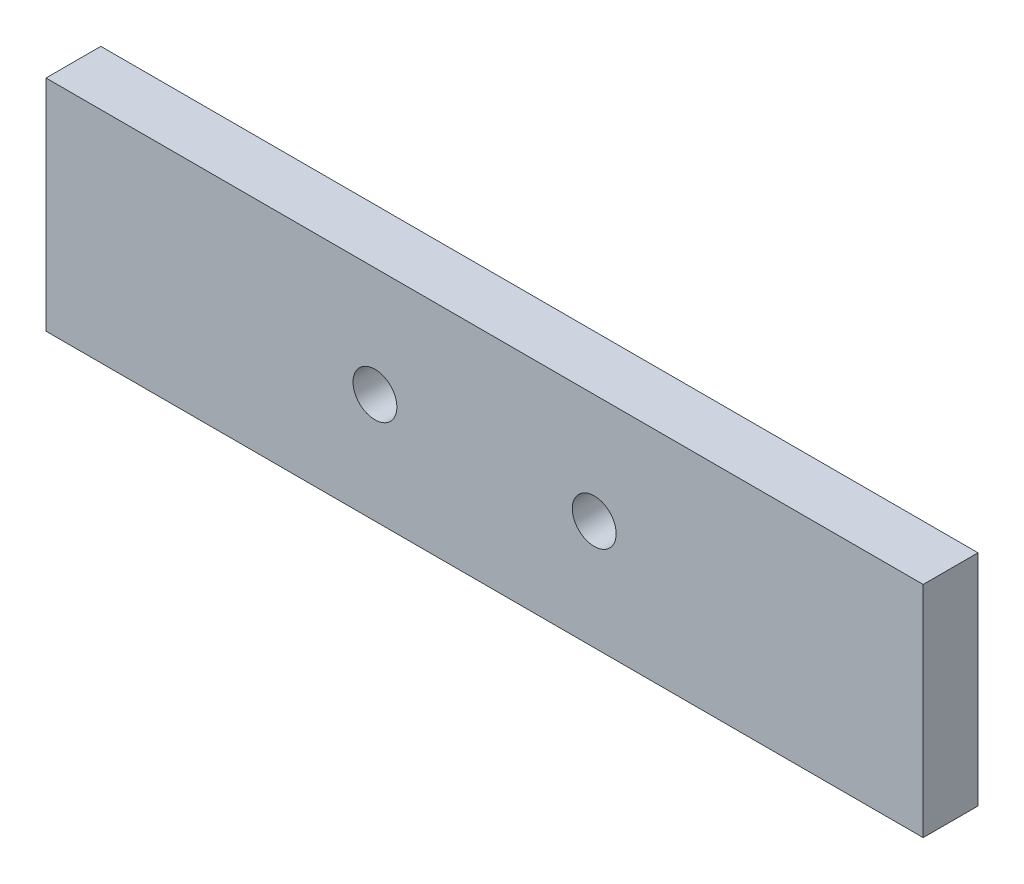
ISO-10303-21;
HEADER;
FILE_DESCRIPTION(('STEP AP214'),'2;1');
FILE_NAME('part.step','',(''),(''),'','','');
FILE_SCHEMA(('AUTOMOTIVE_DESIGN { 1 0 10303 214 1 1 1 1 }'));
ENDSEC;
DATA;
#1=APPLICATION_CONTEXT('core data for automotive mechanical design processes');
#2=APPLICATION_PROTOCOL_DEFINITION('international standard','automotive_design',2000,#1);
#3=PRODUCT_CONTEXT('',#1,'mechanical');
#4=PRODUCT('Part','Part','',(#3));
#5=PRODUCT_RELATED_PRODUCT_CATEGORY('part','',(#4));
#6=PRODUCT_DEFINITION_FORMATION('','',#4);
#7=PRODUCT_DEFINITION_CONTEXT('part definition',#1,'design');
#8=PRODUCT_DEFINITION('design','',#6,#7);
#9=PRODUCT_DEFINITION_SHAPE('','',#8);
#10=(LENGTH_UNIT() NAMED_UNIT(*) SI_UNIT(.MILLI.,.METRE.));
#11=(NAMED_UNIT(*) PLANE_ANGLE_UNIT() SI_UNIT($,.RADIAN.));
#12=(NAMED_UNIT(*) SI_UNIT($,.STERADIAN.) SOLID_ANGLE_UNIT());
#13=UNCERTAINTY_MEASURE_WITH_UNIT(LENGTH_MEASURE(1.E-05),#10,'distance_accuracy_value','');
#14=(GEOMETRIC_REPRESENTATION_CONTEXT(3) GLOBAL_UNCERTAINTY_ASSIGNED_CONTEXT((#13)) GLOBAL_UNIT_ASSIGNED_CONTEXT((#10,
#11,#12)) REPRESENTATION_CONTEXT('',''));
#15=CARTESIAN_POINT('',(0.,0.,0.));
#16=DIRECTION('',(0.,0.,1.));
#17=DIRECTION('',(1.,0.,0.));
#18=AXIS2_PLACEMENT_3D('',#15,#16,#17);
#19=CARTESIAN_POINT('',(8.,10.,5.));
#20=DIRECTION('',(0.,0.,-1.));
#21=DIRECTION('',(-1.,0.,0.));
#22=AXIS2_PLACEMENT_3D('',#19,#20,#21);
#23=CYLINDRICAL_SURFACE('',#22,4.05);
#24=CARTESIAN_POINT('',(8.,10.,0.));
#25=DIRECTION('',(0.,0.,1.));
#26=DIRECTION('',(1.,0.,0.));
#27=AXIS2_PLACEMENT_3D('',#24,#25,#26);
#28=CIRCLE('',#27,4.05);
#29=CARTESIAN_POINT('',(12.05,10.,0.));
#30=VERTEX_POINT('',#29);
#31=EDGE_CURVE('E141',#30,#30,#28,.T.);
#32=ORIENTED_EDGE('',*,*,#31,.F.);
#33=EDGE_LOOP('',(#32));
#34=FACE_BOUND('',#33,.T.);
#35=CARTESIAN_POINT('',(8.,10.,2.9));
#36=DIRECTION('',(0.,0.,1.));
#37=DIRECTION('',(1.,0.,0.));
#38=AXIS2_PLACEMENT_3D('',#35,#36,#37);
#39=CIRCLE('',#38,4.05);
#40=CARTESIAN_POINT('',(12.05,10.,2.9));
#41=VERTEX_POINT('',#40);
#42=EDGE_CURVE('E49',#41,#41,#39,.T.);
#43=ORIENTED_EDGE('',*,*,#42,.T.);
#44=EDGE_LOOP('',(#43));
#45=FACE_BOUND('',#44,.T.);
#46=ADVANCED_FACE('F45',(#34,#45),#23,.F.);
#47=CARTESIAN_POINT('',(72.,10.,5.));
#48=DIRECTION('',(0.,0.,-1.));
#49=DIRECTION('',(-1.,0.,0.));
#50=AXIS2_PLACEMENT_3D('',#47,#48,#49);
#51=CYLINDRICAL_SURFACE('',#50,4.05);
#52=CARTESIAN_POINT('',(72.,10.,0.));
#53=DIRECTION('',(0.,0.,1.));
#54=DIRECTION('',(1.,0.,0.));
#55=AXIS2_PLACEMENT_3D('',#52,#53,#54);
#56=CIRCLE('',#55,4.05);
#57=CARTESIAN_POINT('',(76.05,10.,0.));
#58=VERTEX_POINT('',#57);
#59=EDGE_CURVE('E135',#58,#58,#56,.T.);
#60=ORIENTED_EDGE('',*,*,#59,.F.);
#61=EDGE_LOOP('',(#60));
#62=FACE_BOUND('',#61,.T.);
#63=CARTESIAN_POINT('',(72.,10.,2.9));
#64=DIRECTION('',(0.,0.,1.));
#65=DIRECTION('',(1.,0.,0.));
#66=AXIS2_PLACEMENT_3D('',#63,#64,#65);
#67=CIRCLE('',#66,4.05);
#68=CARTESIAN_POINT('',(76.05,10.,2.9));
#69=VERTEX_POINT('',#68);
#70=EDGE_CURVE('E132',#69,#69,#67,.T.);
#71=ORIENTED_EDGE('',*,*,#70,.T.);
#72=EDGE_LOOP('',(#71));
#73=FACE_BOUND('',#72,.T.);
#74=ADVANCED_FACE('F158',(#62,#73),#51,.F.);
#75=CARTESIAN_POINT('',(0.,0.,5.));
#76=DIRECTION('',(0.,0.,-1.));
#77=DIRECTION('',(-1.,0.,0.));
#78=AXIS2_PLACEMENT_3D('',#75,#76,#77);
#79=PLANE('',#78);
#80=DIRECTION('',(0.,-1.,0.));
#81=VECTOR('',#80,1.);
#82=CARTESIAN_POINT('',(0.,0.,5.));
#83=LINE('',#82,#81);
#84=CARTESIAN_POINT('',(0.,20.,5.));
#85=VERTEX_POINT('',#84);
#86=CARTESIAN_POINT('',(0.,0.,5.));
#87=VERTEX_POINT('',#86);
#88=EDGE_CURVE('E101',#85,#87,#83,.T.);
#89=ORIENTED_EDGE('',*,*,#88,.T.);
#90=DIRECTION('',(1.,0.,0.));
#91=VECTOR('',#90,1.);
#92=CARTESIAN_POINT('',(0.,0.,5.));
#93=LINE('',#92,#91);
#94=CARTESIAN_POINT('',(80.,0.,5.));
#95=VERTEX_POINT('',#94);
#96=EDGE_CURVE('E95',#87,#95,#93,.T.);
#97=ORIENTED_EDGE('',*,*,#96,.T.);
#98=DIRECTION('',(0.,1.,0.));
#99=VECTOR('',#98,1.);
#100=CARTESIAN_POINT('',(80.,0.,5.));
#101=LINE('',#100,#99);
#102=CARTESIAN_POINT('',(80.,20.,5.));
#103=VERTEX_POINT('',#102);
#104=EDGE_CURVE('E99',#95,#103,#101,.T.);
#105=ORIENTED_EDGE('',*,*,#104,.T.);
#106=DIRECTION('',(-1.,0.,0.));
#107=VECTOR('',#106,1.);
#108=CARTESIAN_POINT('',(0.,20.,5.));
#109=LINE('',#108,#107);
#110=EDGE_CURVE('E65',#103,#85,#109,.T.);
#111=ORIENTED_EDGE('',*,*,#110,.T.);
#112=EDGE_LOOP('',(#89,#97,#105,#111));
#113=FACE_BOUND('',#112,.T.);
#114=CARTESIAN_POINT('',(30.,10.,5.));
#115=DIRECTION('',(0.,0.,1.));
#116=DIRECTION('',(1.,0.,0.));
#117=AXIS2_PLACEMENT_3D('',#114,#115,#116);
#118=CIRCLE('',#117,2.);
#119=CARTESIAN_POINT('',(32.,10.,5.));
#120=VERTEX_POINT('',#119);
#121=EDGE_CURVE('E122',#120,#120,#118,.T.);
#122=ORIENTED_EDGE('',*,*,#121,.F.);
#123=EDGE_LOOP('',(#122));
#124=FACE_BOUND('',#123,.T.);
#125=CARTESIAN_POINT('',(50.,10.,5.));
#126=DIRECTION('',(0.,0.,1.));
#127=DIRECTION('',(1.,0.,0.));
#128=AXIS2_PLACEMENT_3D('',#125,#126,#127);
#129=CIRCLE('',#128,2.);
#130=CARTESIAN_POINT('',(52.,10.,5.));
#131=VERTEX_POINT('',#130);
#132=EDGE_CURVE('E202',#131,#131,#129,.T.);
#133=ORIENTED_EDGE('',*,*,#132,.F.);
#134=EDGE_LOOP('',(#133));
#135=FACE_BOUND('',#134,.T.);
#136=ADVANCED_FACE('F96',(#113,#124,#135),#79,.F.);
#137=CARTESIAN_POINT('',(0.,0.,0.));
#138=DIRECTION('',(0.,0.,-1.));
#139=DIRECTION('',(-1.,0.,0.));
#140=AXIS2_PLACEMENT_3D('',#137,#138,#139);
#141=PLANE('',#140);
#142=ORIENTED_EDGE('',*,*,#31,.T.);
#143=EDGE_LOOP('',(#142));
#144=FACE_BOUND('',#143,.T.);
#145=CARTESIAN_POINT('',(30.,10.,0.));
#146=DIRECTION('',(0.,0.,1.));
#147=DIRECTION('',(1.,0.,0.));
#148=AXIS2_PLACEMENT_3D('',#145,#146,#147);
#149=CIRCLE('',#148,2.);
#150=CARTESIAN_POINT('',(32.,10.,0.));
#151=VERTEX_POINT('',#150);
#152=EDGE_CURVE('E207',#151,#151,#149,.T.);
#153=ORIENTED_EDGE('',*,*,#152,.T.);
#154=EDGE_LOOP('',(#153));
#155=FACE_BOUND('',#154,.T.);
#156=DIRECTION('',(0.,-1.,0.));
#157=VECTOR('',#156,1.);
#158=CARTESIAN_POINT('',(0.,0.,0.));
#159=LINE('',#158,#157);
#160=CARTESIAN_POINT('',(0.,20.,0.));
#161=VERTEX_POINT('',#160);
#162=CARTESIAN_POINT('',(0.,0.,0.));
#163=VERTEX_POINT('',#162);
#164=EDGE_CURVE('E118',#161,#163,#159,.T.);
#165=ORIENTED_EDGE('',*,*,#164,.F.);
#166=DIRECTION('',(-1.,0.,0.));
#167=VECTOR('',#166,1.);
#168=CARTESIAN_POINT('',(0.,20.,0.));
#169=LINE('',#168,#167);
#170=CARTESIAN_POINT('',(80.,20.,0.));
#171=VERTEX_POINT('',#170);
#172=EDGE_CURVE('E88',#171,#161,#169,.T.);
#173=ORIENTED_EDGE('',*,*,#172,.F.);
#174=DIRECTION('',(0.,1.,0.));
#175=VECTOR('',#174,1.);
#176=CARTESIAN_POINT('',(80.,0.,0.));
#177=LINE('',#176,#175);
#178=CARTESIAN_POINT('',(80.,0.,0.));
#179=VERTEX_POINT('',#178);
#180=EDGE_CURVE('E82',#179,#171,#177,.T.);
#181=ORIENTED_EDGE('',*,*,#180,.F.);
#182=DIRECTION('',(1.,0.,0.));
#183=VECTOR('',#182,1.);
#184=CARTESIAN_POINT('',(0.,0.,0.));
#185=LINE('',#184,#183);
#186=EDGE_CURVE('E106',#163,#179,#185,.T.);
#187=ORIENTED_EDGE('',*,*,#186,.F.);
#188=EDGE_LOOP('',(#165,#173,#181,#187));
#189=FACE_BOUND('',#188,.T.);
#190=CARTESIAN_POINT('',(50.,10.,0.));
#191=DIRECTION('',(0.,0.,1.));
#192=DIRECTION('',(1.,0.,0.));
#193=AXIS2_PLACEMENT_3D('',#190,#191,#192);
#194=CIRCLE('',#193,2.);
#195=CARTESIAN_POINT('',(52.,10.,0.));
#196=VERTEX_POINT('',#195);
#197=EDGE_CURVE('E198',#196,#196,#194,.T.);
#198=ORIENTED_EDGE('',*,*,#197,.T.);
#199=EDGE_LOOP('',(#198));
#200=FACE_BOUND('',#199,.T.);
#201=ORIENTED_EDGE('',*,*,#59,.T.);
#202=EDGE_LOOP('',(#201));
#203=FACE_BOUND('',#202,.T.);
#204=ADVANCED_FACE('F178',(#144,#155,#189,#200,#203),#141,.T.);
#205=CARTESIAN_POINT('',(0.,0.,5.));
#206=DIRECTION('',(1.,0.,0.));
#207=DIRECTION('',(0.,0.,-1.));
#208=AXIS2_PLACEMENT_3D('',#205,#206,#207);
#209=PLANE('',#208);
#210=ORIENTED_EDGE('',*,*,#164,.T.);
#211=DIRECTION('',(0.,0.,-1.));
#212=VECTOR('',#211,1.);
#213=CARTESIAN_POINT('',(0.,0.,5.));
#214=LINE('',#213,#212);
#215=EDGE_CURVE('E11',#87,#163,#214,.T.);
#216=ORIENTED_EDGE('',*,*,#215,.F.);
#217=ORIENTED_EDGE('',*,*,#88,.F.);
#218=DIRECTION('',(0.,0.,-1.));
#219=VECTOR('',#218,1.);
#220=CARTESIAN_POINT('',(0.,20.,5.));
#221=LINE('',#220,#219);
#222=EDGE_CURVE('E114',#85,#161,#221,.T.);
#223=ORIENTED_EDGE('',*,*,#222,.T.);
#224=EDGE_LOOP('',(#210,#216,#217,#223));
#225=FACE_BOUND('',#224,.T.);
#226=ADVANCED_FACE('F47',(#225),#209,.F.);
#227=CARTESIAN_POINT('',(0.,0.,5.));
#228=DIRECTION('',(0.,1.,0.));
#229=DIRECTION('',(0.,0.,1.));
#230=AXIS2_PLACEMENT_3D('',#227,#228,#229);
#231=PLANE('',#230);
#232=ORIENTED_EDGE('',*,*,#186,.T.);
#233=DIRECTION('',(0.,0.,-1.));
#234=VECTOR('',#233,1.);
#235=CARTESIAN_POINT('',(80.,0.,5.));
#236=LINE('',#235,#234);
#237=EDGE_CURVE('E56',#95,#179,#236,.T.);
#238=ORIENTED_EDGE('',*,*,#237,.F.);
#239=ORIENTED_EDGE('',*,*,#96,.F.);
#240=ORIENTED_EDGE('',*,*,#215,.T.);
#241=EDGE_LOOP('',(#232,#238,#239,#240));
#242=FACE_BOUND('',#241,.T.);
#243=ADVANCED_FACE('F105',(#242),#231,.F.);
#244=CARTESIAN_POINT('',(80.,0.,5.));
#245=DIRECTION('',(-1.,0.,0.));
#246=DIRECTION('',(0.,0.,1.));
#247=AXIS2_PLACEMENT_3D('',#244,#245,#246);
#248=PLANE('',#247);
#249=ORIENTED_EDGE('',*,*,#180,.T.);
#250=DIRECTION('',(0.,0.,-1.));
#251=VECTOR('',#250,1.);
#252=CARTESIAN_POINT('',(80.,20.,5.));
#253=LINE('',#252,#251);
#254=EDGE_CURVE('E108',#103,#171,#253,.T.);
#255=ORIENTED_EDGE('',*,*,#254,.F.);
#256=ORIENTED_EDGE('',*,*,#104,.F.);
#257=ORIENTED_EDGE('',*,*,#237,.T.);
#258=EDGE_LOOP('',(#249,#255,#256,#257));
#259=FACE_BOUND('',#258,.T.);
#260=ADVANCED_FACE('F110',(#259),#248,.F.);
#261=CARTESIAN_POINT('',(0.,20.,5.));
#262=DIRECTION('',(0.,-1.,0.));
#263=DIRECTION('',(0.,0.,-1.));
#264=AXIS2_PLACEMENT_3D('',#261,#262,#263);
#265=PLANE('',#264);
#266=ORIENTED_EDGE('',*,*,#172,.T.);
#267=ORIENTED_EDGE('',*,*,#222,.F.);
#268=ORIENTED_EDGE('',*,*,#110,.F.);
#269=ORIENTED_EDGE('',*,*,#254,.T.);
#270=EDGE_LOOP('',(#266,#267,#268,#269));
#271=FACE_BOUND('',#270,.T.);
#272=ADVANCED_FACE('F174',(#271),#265,.F.);
#273=CARTESIAN_POINT('',(30.,10.,5.));
#274=DIRECTION('',(0.,0.,-1.));
#275=DIRECTION('',(-1.,0.,0.));
#276=AXIS2_PLACEMENT_3D('',#273,#274,#275);
#277=CYLINDRICAL_SURFACE('',#276,2.);
#278=ORIENTED_EDGE('',*,*,#121,.T.);
#279=EDGE_LOOP('',(#278));
#280=FACE_BOUND('',#279,.T.);
#281=ORIENTED_EDGE('',*,*,#152,.F.);
#282=EDGE_LOOP('',(#281));
#283=FACE_BOUND('',#282,.T.);
#284=ADVANCED_FACE('F170',(#280,#283),#277,.F.);
#285=CARTESIAN_POINT('',(50.,10.,5.));
#286=DIRECTION('',(0.,0.,-1.));
#287=DIRECTION('',(-1.,0.,0.));
#288=AXIS2_PLACEMENT_3D('',#285,#286,#287);
#289=CYLINDRICAL_SURFACE('',#288,2.);
#290=ORIENTED_EDGE('',*,*,#132,.T.);
#291=EDGE_LOOP('',(#290));
#292=FACE_BOUND('',#291,.T.);
#293=ORIENTED_EDGE('',*,*,#197,.F.);
#294=EDGE_LOOP('',(#293));
#295=FACE_BOUND('',#294,.T.);
#296=ADVANCED_FACE('F154',(#292,#295),#289,.F.);
#297=CARTESIAN_POINT('',(73.,10.,2.9));
#298=DIRECTION('',(0.,0.,1.));
#299=DIRECTION('',(1.,0.,0.));
#300=AXIS2_PLACEMENT_3D('',#297,#298,#299);
#301=PLANE('',#300);
#302=ORIENTED_EDGE('',*,*,#70,.F.);
#303=EDGE_LOOP('',(#302));
#304=FACE_BOUND('',#303,.T.);
#305=ADVANCED_FACE('F149',(#304),#301,.F.);
#306=CARTESIAN_POINT('',(8.,10.,2.9));
#307=DIRECTION('',(0.,0.,1.));
#308=DIRECTION('',(1.,0.,0.));
#309=AXIS2_PLACEMENT_3D('',#306,#307,#308);
#310=PLANE('',#309);
#311=ORIENTED_EDGE('',*,*,#42,.F.);
#312=EDGE_LOOP('',(#311));
#313=FACE_BOUND('',#312,.T.);
#314=ADVANCED_FACE('F147',(#313),#310,.F.);
#315=CLOSED_SHELL('',(#46,#74,#136,#204,#226,#243,#260,#272,#284,#296,#305,#314));
#316=MANIFOLD_SOLID_BREP('B2',#315);
#317=ADVANCED_BREP_SHAPE_REPRESENTATION('',(#18,#316),#14);
#318=SHAPE_DEFINITION_REPRESENTATION(#9,#317);
ENDSEC;
END-ISO-10303-21;
